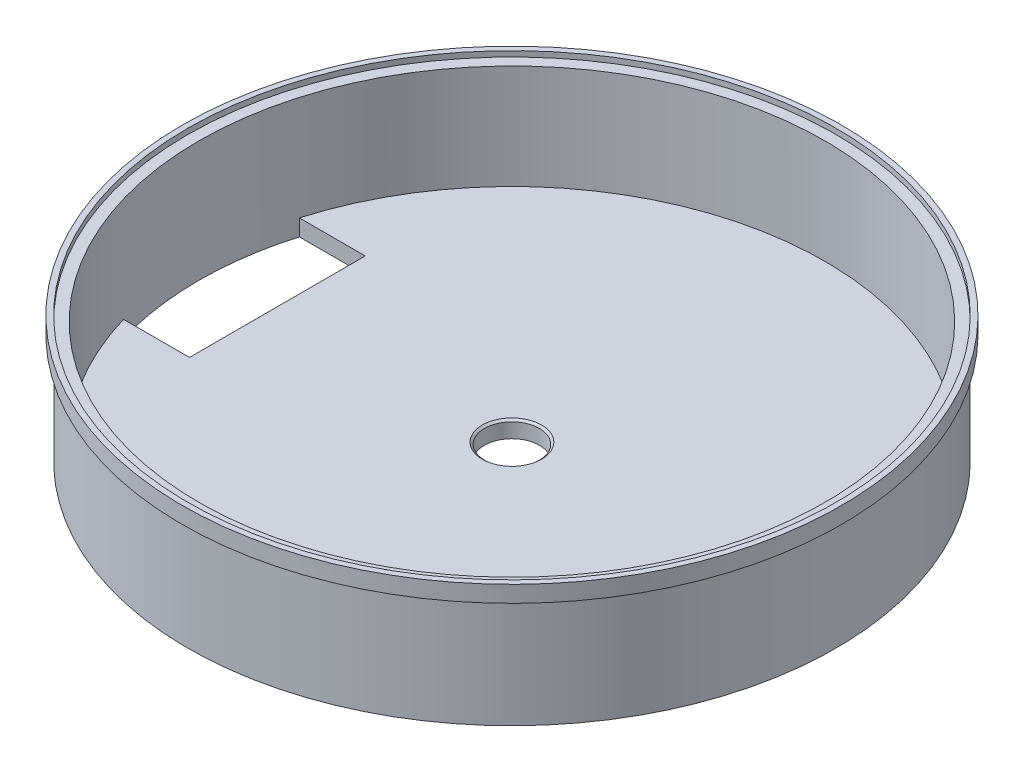
ISO-10303-21;
HEADER;
FILE_DESCRIPTION(('STEP AP214'),'2;1');
FILE_NAME('part.step','',(''),(''),'','','');
FILE_SCHEMA(('AUTOMOTIVE_DESIGN { 1 0 10303 214 1 1 1 1 }'));
ENDSEC;
DATA;
#1=APPLICATION_CONTEXT('core data for automotive mechanical design processes');
#2=APPLICATION_PROTOCOL_DEFINITION('international standard','automotive_design',2000,#1);
#3=PRODUCT_CONTEXT('',#1,'mechanical');
#4=PRODUCT('Part','Part','',(#3));
#5=PRODUCT_RELATED_PRODUCT_CATEGORY('part','',(#4));
#6=PRODUCT_DEFINITION_FORMATION('','',#4);
#7=PRODUCT_DEFINITION_CONTEXT('part definition',#1,'design');
#8=PRODUCT_DEFINITION('design','',#6,#7);
#9=PRODUCT_DEFINITION_SHAPE('','',#8);
#10=(LENGTH_UNIT() NAMED_UNIT(*) SI_UNIT(.MILLI.,.METRE.));
#11=(NAMED_UNIT(*) PLANE_ANGLE_UNIT() SI_UNIT($,.RADIAN.));
#12=(NAMED_UNIT(*) SI_UNIT($,.STERADIAN.) SOLID_ANGLE_UNIT());
#13=UNCERTAINTY_MEASURE_WITH_UNIT(LENGTH_MEASURE(1.E-05),#10,'distance_accuracy_value','');
#14=(GEOMETRIC_REPRESENTATION_CONTEXT(3) GLOBAL_UNCERTAINTY_ASSIGNED_CONTEXT((#13)) GLOBAL_UNIT_ASSIGNED_CONTEXT((#10,
#11,#12)) REPRESENTATION_CONTEXT('',''));
#15=CARTESIAN_POINT('',(0.,0.,0.));
#16=DIRECTION('',(0.,0.,1.));
#17=DIRECTION('',(1.,0.,0.));
#18=AXIS2_PLACEMENT_3D('',#15,#16,#17);
#19=CARTESIAN_POINT('',(-93.6625,5.19300847457626,0.));
#20=DIRECTION('',(0.,1.,0.));
#21=DIRECTION('',(-1.,0.,0.));
#22=AXIS2_PLACEMENT_3D('',#19,#20,#21);
#23=PLANE('',#22);
#24=CARTESIAN_POINT('',(0.,5.19300847457627,0.));
#25=DIRECTION('',(0.,1.,0.));
#26=DIRECTION('',(-1.,0.,0.));
#27=AXIS2_PLACEMENT_3D('',#24,#25,#26);
#28=CIRCLE('',#27,95.25);
#29=CARTESIAN_POINT('',(-95.25,5.19300847457626,0.));
#30=VERTEX_POINT('',#29);
#31=EDGE_CURVE('E11',#30,#30,#28,.T.);
#32=ORIENTED_EDGE('',*,*,#31,.T.);
#33=EDGE_LOOP('',(#32));
#34=FACE_BOUND('',#33,.T.);
#35=CARTESIAN_POINT('',(0.,5.19300847457627,0.));
#36=DIRECTION('',(0.,1.,0.));
#37=DIRECTION('',(-1.,0.,0.));
#38=AXIS2_PLACEMENT_3D('',#35,#36,#37);
#39=CIRCLE('',#38,93.6625);
#40=CARTESIAN_POINT('',(-93.6625,5.19300847457626,0.));
#41=VERTEX_POINT('',#40);
#42=EDGE_CURVE('E149',#41,#41,#39,.T.);
#43=ORIENTED_EDGE('',*,*,#42,.F.);
#44=EDGE_LOOP('',(#43));
#45=FACE_BOUND('',#44,.T.);
#46=ADVANCED_FACE('F43',(#34,#45),#23,.T.);
#47=CARTESIAN_POINT('',(0.,0.,0.));
#48=DIRECTION('',(0.,1.,0.));
#49=DIRECTION('',(-1.,0.,0.));
#50=AXIS2_PLACEMENT_3D('',#47,#48,#49);
#51=CYLINDRICAL_SURFACE('',#50,95.25);
#52=CARTESIAN_POINT('',(0.,0.430508474576268,0.));
#53=DIRECTION('',(0.,1.,0.));
#54=DIRECTION('',(-1.,0.,0.));
#55=AXIS2_PLACEMENT_3D('',#52,#53,#54);
#56=CIRCLE('',#55,95.25);
#57=CARTESIAN_POINT('',(-95.25,0.430508474576263,0.));
#58=VERTEX_POINT('',#57);
#59=EDGE_CURVE('E51',#58,#58,#56,.T.);
#60=ORIENTED_EDGE('',*,*,#59,.T.);
#61=EDGE_LOOP('',(#60));
#62=FACE_BOUND('',#61,.T.);
#63=ORIENTED_EDGE('',*,*,#31,.F.);
#64=EDGE_LOOP('',(#63));
#65=FACE_BOUND('',#64,.T.);
#66=ADVANCED_FACE('F126',(#62,#65),#51,.T.);
#67=CARTESIAN_POINT('',(-95.25,0.430508474576263,0.));
#68=DIRECTION('',(0.,-1.,0.));
#69=DIRECTION('',(1.,0.,0.));
#70=AXIS2_PLACEMENT_3D('',#67,#68,#69);
#71=PLANE('',#70);
#72=CARTESIAN_POINT('',(0.,0.430508474576268,0.));
#73=DIRECTION('',(0.,1.,0.));
#74=DIRECTION('',(-1.,0.,0.));
#75=AXIS2_PLACEMENT_3D('',#72,#73,#74);
#76=CIRCLE('',#75,93.6625);
#77=CARTESIAN_POINT('',(-93.6625,0.430508474576263,0.));
#78=VERTEX_POINT('',#77);
#79=EDGE_CURVE('E113',#78,#78,#76,.T.);
#80=ORIENTED_EDGE('',*,*,#79,.T.);
#81=EDGE_LOOP('',(#80));
#82=FACE_BOUND('',#81,.T.);
#83=ORIENTED_EDGE('',*,*,#59,.F.);
#84=EDGE_LOOP('',(#83));
#85=FACE_BOUND('',#84,.T.);
#86=ADVANCED_FACE('F129',(#82,#85),#71,.T.);
#87=CARTESIAN_POINT('',(0.,0.,0.));
#88=DIRECTION('',(0.,1.,0.));
#89=DIRECTION('',(-1.,0.,0.));
#90=AXIS2_PLACEMENT_3D('',#87,#88,#89);
#91=CYLINDRICAL_SURFACE('',#90,93.6625);
#92=CARTESIAN_POINT('',(0.,-31.3194915254237,0.));
#93=DIRECTION('',(0.,1.,0.));
#94=DIRECTION('',(-1.,0.,0.));
#95=AXIS2_PLACEMENT_3D('',#92,#93,#94);
#96=CIRCLE('',#95,93.6625);
#97=CARTESIAN_POINT('',(-93.6625,-31.3194915254237,0.));
#98=VERTEX_POINT('',#97);
#99=EDGE_CURVE('E107',#98,#98,#96,.T.);
#100=ORIENTED_EDGE('',*,*,#99,.T.);
#101=EDGE_LOOP('',(#100));
#102=FACE_BOUND('',#101,.T.);
#103=ORIENTED_EDGE('',*,*,#79,.F.);
#104=EDGE_LOOP('',(#103));
#105=FACE_BOUND('',#104,.T.);
#106=ADVANCED_FACE('F131',(#102,#105),#91,.T.);
#107=CARTESIAN_POINT('',(-93.6625,-31.3194915254237,0.));
#108=DIRECTION('',(0.,-1.,0.));
#109=DIRECTION('',(1.,0.,0.));
#110=AXIS2_PLACEMENT_3D('',#107,#108,#109);
#111=PLANE('',#110);
#112=CARTESIAN_POINT('',(2.37424972085223E-13,-31.3194915254237,0.));
#113=DIRECTION('',(0.,-1.,0.));
#114=DIRECTION('',(1.,0.,0.));
#115=AXIS2_PLACEMENT_3D('',#112,#113,#114);
#116=CIRCLE('',#115,90.4875000000002);
#117=CARTESIAN_POINT('',(-86.8494539778461,-31.3194915254237,25.4));
#118=VERTEX_POINT('',#117);
#119=CARTESIAN_POINT('',(-86.8494539778461,-31.3194915254237,-25.4));
#120=VERTEX_POINT('',#119);
#121=EDGE_CURVE('E168',#118,#120,#116,.T.);
#122=ORIENTED_EDGE('',*,*,#121,.F.);
#123=DIRECTION('',(-1.,0.,0.));
#124=VECTOR('',#123,1.);
#125=CARTESIAN_POINT('',(-93.6625,-31.3194915254237,25.4));
#126=LINE('',#125,#124);
#127=CARTESIAN_POINT('',(-67.7994539778461,-31.3194915254237,25.4));
#128=VERTEX_POINT('',#127);
#129=EDGE_CURVE('E89',#128,#118,#126,.T.);
#130=ORIENTED_EDGE('',*,*,#129,.F.);
#131=DIRECTION('',(0.,0.,1.));
#132=VECTOR('',#131,1.);
#133=CARTESIAN_POINT('',(-67.7994539778461,-31.3194915254237,0.));
#134=LINE('',#133,#132);
#135=CARTESIAN_POINT('',(-67.7994539778461,-31.3194915254237,-25.4));
#136=VERTEX_POINT('',#135);
#137=EDGE_CURVE('E174',#136,#128,#134,.T.);
#138=ORIENTED_EDGE('',*,*,#137,.F.);
#139=DIRECTION('',(1.,0.,0.));
#140=VECTOR('',#139,1.);
#141=CARTESIAN_POINT('',(-93.6625,-31.3194915254237,-25.4));
#142=LINE('',#141,#140);
#143=EDGE_CURVE('E171',#120,#136,#142,.T.);
#144=ORIENTED_EDGE('',*,*,#143,.F.);
#145=EDGE_LOOP('',(#122,#130,#138,#144));
#146=FACE_BOUND('',#145,.T.);
#147=CARTESIAN_POINT('',(0.,-31.3194915254237,0.));
#148=DIRECTION('',(0.,1.,0.));
#149=DIRECTION('',(0.,0.,1.));
#150=AXIS2_PLACEMENT_3D('',#147,#148,#149);
#151=CIRCLE('',#150,7.93749999999999);
#152=CARTESIAN_POINT('',(0.,-31.3194915254237,7.93749999999999));
#153=VERTEX_POINT('',#152);
#154=EDGE_CURVE('E152',#153,#153,#151,.T.);
#155=ORIENTED_EDGE('',*,*,#154,.T.);
#156=EDGE_LOOP('',(#155));
#157=FACE_BOUND('',#156,.T.);
#158=ORIENTED_EDGE('',*,*,#99,.F.);
#159=EDGE_LOOP('',(#158));
#160=FACE_BOUND('',#159,.T.);
#161=ADVANCED_FACE('F138',(#146,#157,#160),#111,.T.);
#162=CARTESIAN_POINT('',(0.,-26.5569915254237,0.));
#163=DIRECTION('',(0.,1.,0.));
#164=DIRECTION('',(-1.,0.,0.));
#165=AXIS2_PLACEMENT_3D('',#162,#163,#164);
#166=PLANE('',#165);
#167=DIRECTION('',(-1.,0.,0.));
#168=VECTOR('',#167,1.);
#169=CARTESIAN_POINT('',(-86.8494539778461,-26.5569915254237,-25.4));
#170=LINE('',#169,#168);
#171=CARTESIAN_POINT('',(-67.7994539778461,-26.5569915254237,-25.4));
#172=VERTEX_POINT('',#171);
#173=CARTESIAN_POINT('',(-86.8494539778461,-26.5569915254237,-25.4));
#174=VERTEX_POINT('',#173);
#175=EDGE_CURVE('E66',#172,#174,#170,.T.);
#176=ORIENTED_EDGE('',*,*,#175,.F.);
#177=DIRECTION('',(0.,0.,-1.));
#178=VECTOR('',#177,1.);
#179=CARTESIAN_POINT('',(-67.7994539778461,-26.5569915254237,-25.4));
#180=LINE('',#179,#178);
#181=CARTESIAN_POINT('',(-67.7994539778461,-26.5569915254237,25.4));
#182=VERTEX_POINT('',#181);
#183=EDGE_CURVE('E101',#182,#172,#180,.T.);
#184=ORIENTED_EDGE('',*,*,#183,.F.);
#185=DIRECTION('',(1.,0.,0.));
#186=VECTOR('',#185,1.);
#187=CARTESIAN_POINT('',(-67.7994539778461,-26.5569915254237,25.4));
#188=LINE('',#187,#186);
#189=CARTESIAN_POINT('',(-86.8494539778461,-26.5569915254237,25.4));
#190=VERTEX_POINT('',#189);
#191=EDGE_CURVE('E86',#190,#182,#188,.T.);
#192=ORIENTED_EDGE('',*,*,#191,.F.);
#193=CARTESIAN_POINT('',(0.,-26.5569915254237,0.));
#194=DIRECTION('',(0.,1.,0.));
#195=DIRECTION('',(-1.,0.,0.));
#196=AXIS2_PLACEMENT_3D('',#193,#194,#195);
#197=CIRCLE('',#196,90.4875);
#198=EDGE_CURVE('E99',#190,#174,#197,.T.);
#199=ORIENTED_EDGE('',*,*,#198,.T.);
#200=EDGE_LOOP('',(#176,#184,#192,#199));
#201=FACE_BOUND('',#200,.T.);
#202=CARTESIAN_POINT('',(0.,-26.5569915254237,0.));
#203=DIRECTION('',(0.,1.,0.));
#204=DIRECTION('',(0.,0.,1.));
#205=AXIS2_PLACEMENT_3D('',#202,#203,#204);
#206=CIRCLE('',#205,8.5725);
#207=CARTESIAN_POINT('',(0.,-26.5569915254237,8.5725));
#208=VERTEX_POINT('',#207);
#209=EDGE_CURVE('E164',#208,#208,#206,.T.);
#210=ORIENTED_EDGE('',*,*,#209,.F.);
#211=EDGE_LOOP('',(#210));
#212=FACE_BOUND('',#211,.T.);
#213=ADVANCED_FACE('F97',(#201,#212),#166,.T.);
#214=CARTESIAN_POINT('',(0.,0.,0.));
#215=DIRECTION('',(0.,1.,0.));
#216=DIRECTION('',(-1.,0.,0.));
#217=AXIS2_PLACEMENT_3D('',#214,#215,#216);
#218=CYLINDRICAL_SURFACE('',#217,90.4875);
#219=CARTESIAN_POINT('',(0.,3.60550847457627,0.));
#220=DIRECTION('',(0.,1.,0.));
#221=DIRECTION('',(-1.,0.,0.));
#222=AXIS2_PLACEMENT_3D('',#219,#220,#221);
#223=CIRCLE('',#222,90.4875);
#224=CARTESIAN_POINT('',(-90.4875,3.60550847457626,0.));
#225=VERTEX_POINT('',#224);
#226=EDGE_CURVE('E108',#225,#225,#223,.T.);
#227=ORIENTED_EDGE('',*,*,#226,.T.);
#228=EDGE_LOOP('',(#227));
#229=FACE_BOUND('',#228,.T.);
#230=ORIENTED_EDGE('',*,*,#198,.F.);
#231=DIRECTION('',(0.,1.,0.));
#232=VECTOR('',#231,1.);
#233=CARTESIAN_POINT('',(-86.8494539778461,-51.9569915254237,25.4));
#234=LINE('',#233,#232);
#235=EDGE_CURVE('E83',#118,#190,#234,.T.);
#236=ORIENTED_EDGE('',*,*,#235,.F.);
#237=ORIENTED_EDGE('',*,*,#121,.T.);
#238=DIRECTION('',(0.,1.,0.));
#239=VECTOR('',#238,1.);
#240=CARTESIAN_POINT('',(-86.8494539778461,-51.9569915254237,-25.4));
#241=LINE('',#240,#239);
#242=EDGE_CURVE('E105',#120,#174,#241,.T.);
#243=ORIENTED_EDGE('',*,*,#242,.T.);
#244=EDGE_LOOP('',(#230,#236,#237,#243));
#245=FACE_BOUND('',#244,.T.);
#246=ADVANCED_FACE('F104',(#229,#245),#218,.F.);
#247=CARTESIAN_POINT('',(-90.4875,3.60550847457626,0.));
#248=DIRECTION('',(0.,1.,0.));
#249=DIRECTION('',(-1.,0.,0.));
#250=AXIS2_PLACEMENT_3D('',#247,#248,#249);
#251=PLANE('',#250);
#252=CARTESIAN_POINT('',(0.,3.60550847457627,0.));
#253=DIRECTION('',(0.,1.,0.));
#254=DIRECTION('',(-1.,0.,0.));
#255=AXIS2_PLACEMENT_3D('',#252,#253,#254);
#256=CIRCLE('',#255,93.6625);
#257=CARTESIAN_POINT('',(-93.6625,3.60550847457626,0.));
#258=VERTEX_POINT('',#257);
#259=EDGE_CURVE('E116',#258,#258,#256,.T.);
#260=ORIENTED_EDGE('',*,*,#259,.T.);
#261=EDGE_LOOP('',(#260));
#262=FACE_BOUND('',#261,.T.);
#263=ORIENTED_EDGE('',*,*,#226,.F.);
#264=EDGE_LOOP('',(#263));
#265=FACE_BOUND('',#264,.T.);
#266=ADVANCED_FACE('F218',(#262,#265),#251,.T.);
#267=CARTESIAN_POINT('',(0.,0.,0.));
#268=DIRECTION('',(0.,1.,0.));
#269=DIRECTION('',(-1.,0.,0.));
#270=AXIS2_PLACEMENT_3D('',#267,#268,#269);
#271=CYLINDRICAL_SURFACE('',#270,93.6625);
#272=ORIENTED_EDGE('',*,*,#42,.T.);
#273=EDGE_LOOP('',(#272));
#274=FACE_BOUND('',#273,.T.);
#275=ORIENTED_EDGE('',*,*,#259,.F.);
#276=EDGE_LOOP('',(#275));
#277=FACE_BOUND('',#276,.T.);
#278=ADVANCED_FACE('F214',(#274,#277),#271,.F.);
#279=CARTESIAN_POINT('',(0.,-26.5569915254237,0.));
#280=DIRECTION('',(0.,1.,0.));
#281=DIRECTION('',(0.,0.,1.));
#282=AXIS2_PLACEMENT_3D('',#279,#280,#281);
#283=CYLINDRICAL_SURFACE('',#282,7.9375);
#284=ORIENTED_EDGE('',*,*,#154,.F.);
#285=EDGE_LOOP('',(#284));
#286=FACE_BOUND('',#285,.T.);
#287=CARTESIAN_POINT('',(0.,-27.0898197912213,0.));
#288=DIRECTION('',(0.,1.,0.));
#289=DIRECTION('',(0.,0.,1.));
#290=AXIS2_PLACEMENT_3D('',#287,#288,#289);
#291=CIRCLE('',#290,7.9375);
#292=CARTESIAN_POINT('',(0.,-27.0898197912213,7.9375));
#293=VERTEX_POINT('',#292);
#294=EDGE_CURVE('E158',#293,#293,#291,.T.);
#295=ORIENTED_EDGE('',*,*,#294,.T.);
#296=EDGE_LOOP('',(#295));
#297=FACE_BOUND('',#296,.T.);
#298=ADVANCED_FACE('F206',(#286,#297),#283,.F.);
#299=CARTESIAN_POINT('',(0.,-26.5569915254237,0.));
#300=DIRECTION('',(0.,1.,0.));
#301=DIRECTION('',(0.,0.,1.));
#302=AXIS2_PLACEMENT_3D('',#299,#300,#301);
#303=CONICAL_SURFACE('',#302,8.5725,0.872664625997166);
#304=ORIENTED_EDGE('',*,*,#294,.F.);
#305=EDGE_LOOP('',(#304));
#306=FACE_BOUND('',#305,.T.);
#307=ORIENTED_EDGE('',*,*,#209,.T.);
#308=EDGE_LOOP('',(#307));
#309=FACE_BOUND('',#308,.T.);
#310=ADVANCED_FACE('F198',(#306,#309),#303,.F.);
#311=CARTESIAN_POINT('',(-86.8494539778461,-51.9569915254237,-25.4));
#312=DIRECTION('',(0.,0.,-1.));
#313=DIRECTION('',(-1.,0.,0.));
#314=AXIS2_PLACEMENT_3D('',#311,#312,#313);
#315=PLANE('',#314);
#316=ORIENTED_EDGE('',*,*,#143,.T.);
#317=DIRECTION('',(0.,1.,0.));
#318=VECTOR('',#317,1.);
#319=CARTESIAN_POINT('',(-67.7994539778461,-51.9569915254237,-25.4));
#320=LINE('',#319,#318);
#321=EDGE_CURVE('E181',#136,#172,#320,.T.);
#322=ORIENTED_EDGE('',*,*,#321,.T.);
#323=ORIENTED_EDGE('',*,*,#175,.T.);
#324=ORIENTED_EDGE('',*,*,#242,.F.);
#325=EDGE_LOOP('',(#316,#322,#323,#324));
#326=FACE_BOUND('',#325,.T.);
#327=ADVANCED_FACE('F196',(#326),#315,.F.);
#328=CARTESIAN_POINT('',(-67.7994539778461,-51.9569915254237,-25.4));
#329=DIRECTION('',(1.,0.,0.));
#330=DIRECTION('',(0.,1.,0.));
#331=AXIS2_PLACEMENT_3D('',#328,#329,#330);
#332=PLANE('',#331);
#333=ORIENTED_EDGE('',*,*,#137,.T.);
#334=DIRECTION('',(0.,1.,0.));
#335=VECTOR('',#334,1.);
#336=CARTESIAN_POINT('',(-67.7994539778461,-51.9569915254237,25.4));
#337=LINE('',#336,#335);
#338=EDGE_CURVE('E58',#128,#182,#337,.T.);
#339=ORIENTED_EDGE('',*,*,#338,.T.);
#340=ORIENTED_EDGE('',*,*,#183,.T.);
#341=ORIENTED_EDGE('',*,*,#321,.F.);
#342=EDGE_LOOP('',(#333,#339,#340,#341));
#343=FACE_BOUND('',#342,.T.);
#344=ADVANCED_FACE('F191',(#343),#332,.F.);
#345=CARTESIAN_POINT('',(-67.7994539778461,-51.9569915254237,25.4));
#346=DIRECTION('',(0.,0.,1.));
#347=DIRECTION('',(1.,0.,0.));
#348=AXIS2_PLACEMENT_3D('',#345,#346,#347);
#349=PLANE('',#348);
#350=ORIENTED_EDGE('',*,*,#129,.T.);
#351=ORIENTED_EDGE('',*,*,#235,.T.);
#352=ORIENTED_EDGE('',*,*,#191,.T.);
#353=ORIENTED_EDGE('',*,*,#338,.F.);
#354=EDGE_LOOP('',(#350,#351,#352,#353));
#355=FACE_BOUND('',#354,.T.);
#356=ADVANCED_FACE('F85',(#355),#349,.F.);
#357=CLOSED_SHELL('',(#46,#66,#86,#106,#161,#213,#246,#266,#278,#298,#310,#327,#344,#356));
#358=MANIFOLD_SOLID_BREP('B2',#357);
#359=ADVANCED_BREP_SHAPE_REPRESENTATION('',(#18,#358),#14);
#360=SHAPE_DEFINITION_REPRESENTATION(#9,#359);
ENDSEC;
END-ISO-10303-21;
